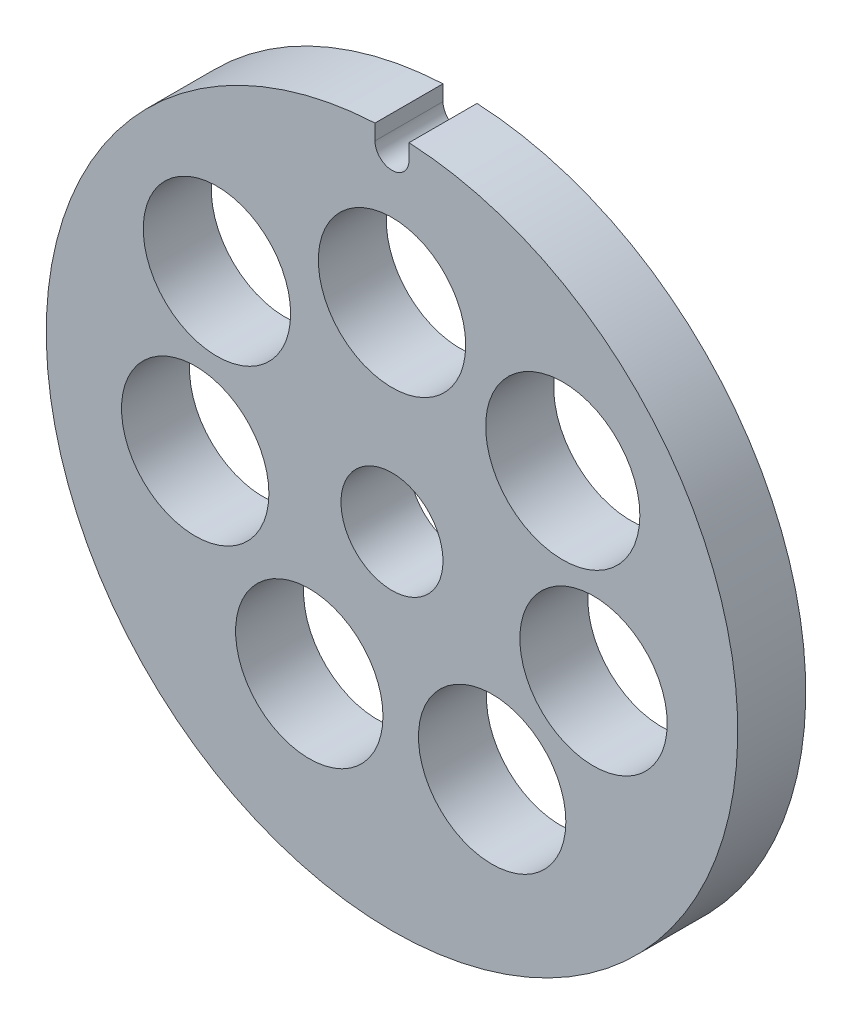
ISO-10303-21;
HEADER;
FILE_DESCRIPTION(('STEP AP214'),'2;1');
FILE_NAME('part.step','',(''),(''),'','','');
FILE_SCHEMA(('AUTOMOTIVE_DESIGN { 1 0 10303 214 1 1 1 1 }'));
ENDSEC;
DATA;
#1=APPLICATION_CONTEXT('core data for automotive mechanical design processes');
#2=APPLICATION_PROTOCOL_DEFINITION('international standard','automotive_design',2000,#1);
#3=PRODUCT_CONTEXT('',#1,'mechanical');
#4=PRODUCT('Part','Part','',(#3));
#5=PRODUCT_RELATED_PRODUCT_CATEGORY('part','',(#4));
#6=PRODUCT_DEFINITION_FORMATION('','',#4);
#7=PRODUCT_DEFINITION_CONTEXT('part definition',#1,'design');
#8=PRODUCT_DEFINITION('design','',#6,#7);
#9=PRODUCT_DEFINITION_SHAPE('','',#8);
#10=(LENGTH_UNIT() NAMED_UNIT(*) SI_UNIT(.MILLI.,.METRE.));
#11=(NAMED_UNIT(*) PLANE_ANGLE_UNIT() SI_UNIT($,.RADIAN.));
#12=(NAMED_UNIT(*) SI_UNIT($,.STERADIAN.) SOLID_ANGLE_UNIT());
#13=UNCERTAINTY_MEASURE_WITH_UNIT(LENGTH_MEASURE(1.E-05),#10,'distance_accuracy_value','');
#14=(GEOMETRIC_REPRESENTATION_CONTEXT(3) GLOBAL_UNCERTAINTY_ASSIGNED_CONTEXT((#13)) GLOBAL_UNIT_ASSIGNED_CONTEXT((#10,
#11,#12)) REPRESENTATION_CONTEXT('',''));
#15=CARTESIAN_POINT('',(0.,0.,0.));
#16=DIRECTION('',(0.,0.,1.));
#17=DIRECTION('',(1.,0.,0.));
#18=AXIS2_PLACEMENT_3D('',#15,#16,#17);
#19=CARTESIAN_POINT('',(-19.7988297795738,47.6312890353411,6.));
#20=DIRECTION('',(0.,0.,-1.));
#21=DIRECTION('',(-1.,0.,0.));
#22=AXIS2_PLACEMENT_3D('',#19,#20,#21);
#23=CYLINDRICAL_SURFACE('',#22,1.5);
#24=CARTESIAN_POINT('',(-19.7988297795738,47.6312890353411,0.));
#25=DIRECTION('',(0.,0.,1.));
#26=DIRECTION('',(1.,0.,0.));
#27=AXIS2_PLACEMENT_3D('',#24,#25,#26);
#28=CIRCLE('',#27,1.5);
#29=CARTESIAN_POINT('',(-21.2988297795738,47.6312890353411,0.));
#30=VERTEX_POINT('',#29);
#31=CARTESIAN_POINT('',(-18.2988297795737,47.6312890353411,0.));
#32=VERTEX_POINT('',#31);
#33=EDGE_CURVE('E124',#30,#32,#28,.T.);
#34=ORIENTED_EDGE('',*,*,#33,.F.);
#35=DIRECTION('',(0.,0.,-1.));
#36=VECTOR('',#35,1.);
#37=CARTESIAN_POINT('',(-21.2988297795738,47.6312890353411,6.));
#38=LINE('',#37,#36);
#39=CARTESIAN_POINT('',(-21.2988297795738,47.6312890353411,6.));
#40=VERTEX_POINT('',#39);
#41=EDGE_CURVE('E11',#40,#30,#38,.T.);
#42=ORIENTED_EDGE('',*,*,#41,.F.);
#43=CARTESIAN_POINT('',(-19.7988297795738,47.6312890353411,6.));
#44=DIRECTION('',(0.,0.,1.));
#45=DIRECTION('',(1.,0.,0.));
#46=AXIS2_PLACEMENT_3D('',#43,#44,#45);
#47=CIRCLE('',#46,1.5);
#48=CARTESIAN_POINT('',(-18.2988297795737,47.6312890353411,6.));
#49=VERTEX_POINT('',#48);
#50=EDGE_CURVE('E94',#40,#49,#47,.T.);
#51=ORIENTED_EDGE('',*,*,#50,.T.);
#52=DIRECTION('',(0.,0.,-1.));
#53=VECTOR('',#52,1.);
#54=CARTESIAN_POINT('',(-18.2988297795737,47.6312890353411,6.));
#55=LINE('',#54,#53);
#56=EDGE_CURVE('E74',#49,#32,#55,.T.);
#57=ORIENTED_EDGE('',*,*,#56,.T.);
#58=EDGE_LOOP('',(#34,#42,#51,#57));
#59=FACE_BOUND('',#58,.T.);
#60=ADVANCED_FACE('F36',(#59),#23,.F.);
#61=CARTESIAN_POINT('',(-21.2988297795736,0.,6.));
#62=DIRECTION('',(1.,0.,0.));
#63=DIRECTION('',(0.,1.,0.));
#64=AXIS2_PLACEMENT_3D('',#61,#62,#63);
#65=PLANE('',#64);
#66=DIRECTION('',(0.,-1.,0.));
#67=VECTOR('',#66,1.);
#68=CARTESIAN_POINT('',(-21.2988297795736,0.,0.));
#69=LINE('',#68,#67);
#70=CARTESIAN_POINT('',(-21.2988297795738,48.9943814587968,0.));
#71=VERTEX_POINT('',#70);
#72=EDGE_CURVE('E87',#71,#30,#69,.T.);
#73=ORIENTED_EDGE('',*,*,#72,.F.);
#74=DIRECTION('',(0.,0.,-1.));
#75=VECTOR('',#74,1.);
#76=CARTESIAN_POINT('',(-21.2988297795738,48.9943814587968,6.));
#77=LINE('',#76,#75);
#78=CARTESIAN_POINT('',(-21.2988297795738,48.9943814587968,6.));
#79=VERTEX_POINT('',#78);
#80=EDGE_CURVE('E44',#79,#71,#77,.T.);
#81=ORIENTED_EDGE('',*,*,#80,.F.);
#82=DIRECTION('',(0.,-1.,0.));
#83=VECTOR('',#82,1.);
#84=CARTESIAN_POINT('',(-21.2988297795736,0.,6.));
#85=LINE('',#84,#83);
#86=EDGE_CURVE('E85',#79,#40,#85,.T.);
#87=ORIENTED_EDGE('',*,*,#86,.T.);
#88=ORIENTED_EDGE('',*,*,#41,.T.);
#89=EDGE_LOOP('',(#73,#81,#87,#88));
#90=FACE_BOUND('',#89,.T.);
#91=ADVANCED_FACE('F83',(#90),#65,.T.);
#92=CARTESIAN_POINT('',(-19.7988297795738,18.5312890353411,6.));
#93=DIRECTION('',(0.,0.,-1.));
#94=DIRECTION('',(-1.,0.,0.));
#95=AXIS2_PLACEMENT_3D('',#92,#93,#94);
#96=CYLINDRICAL_SURFACE('',#95,30.5);
#97=CARTESIAN_POINT('',(-19.7988297795738,18.5312890353411,0.));
#98=DIRECTION('',(0.,0.,1.));
#99=DIRECTION('',(1.,0.,0.));
#100=AXIS2_PLACEMENT_3D('',#97,#98,#99);
#101=CIRCLE('',#100,30.5);
#102=CARTESIAN_POINT('',(-18.2988297795738,48.9943814587968,0.));
#103=VERTEX_POINT('',#102);
#104=EDGE_CURVE('E67',#71,#103,#101,.T.);
#105=ORIENTED_EDGE('',*,*,#104,.T.);
#106=DIRECTION('',(0.,0.,-1.));
#107=VECTOR('',#106,1.);
#108=CARTESIAN_POINT('',(-18.2988297795738,48.9943814587968,6.));
#109=LINE('',#108,#107);
#110=CARTESIAN_POINT('',(-18.2988297795738,48.9943814587968,6.));
#111=VERTEX_POINT('',#110);
#112=EDGE_CURVE('E88',#111,#103,#109,.T.);
#113=ORIENTED_EDGE('',*,*,#112,.F.);
#114=CARTESIAN_POINT('',(-19.7988297795738,18.5312890353411,6.));
#115=DIRECTION('',(0.,0.,1.));
#116=DIRECTION('',(1.,0.,0.));
#117=AXIS2_PLACEMENT_3D('',#114,#115,#116);
#118=CIRCLE('',#117,30.5);
#119=EDGE_CURVE('E89',#79,#111,#118,.T.);
#120=ORIENTED_EDGE('',*,*,#119,.F.);
#121=ORIENTED_EDGE('',*,*,#80,.T.);
#122=EDGE_LOOP('',(#105,#113,#120,#121));
#123=FACE_BOUND('',#122,.T.);
#124=ADVANCED_FACE('F90',(#123),#96,.T.);
#125=CARTESIAN_POINT('',(-19.797413553315,36.0312889780355,6.));
#126=DIRECTION('',(0.,0.,-1.));
#127=DIRECTION('',(-1.,0.,0.));
#128=AXIS2_PLACEMENT_3D('',#125,#126,#127);
#129=CYLINDRICAL_SURFACE('',#128,6.5);
#130=CARTESIAN_POINT('',(-19.797413553315,36.0312889780355,6.));
#131=DIRECTION('',(0.,0.,1.));
#132=DIRECTION('',(1.,0.,0.));
#133=AXIS2_PLACEMENT_3D('',#130,#131,#132);
#134=CIRCLE('',#133,6.5);
#135=CARTESIAN_POINT('',(-13.297413553315,36.0312889780355,6.));
#136=VERTEX_POINT('',#135);
#137=EDGE_CURVE('E118',#136,#136,#134,.T.);
#138=ORIENTED_EDGE('',*,*,#137,.T.);
#139=EDGE_LOOP('',(#138));
#140=FACE_BOUND('',#139,.T.);
#141=CARTESIAN_POINT('',(-19.797413553315,36.0312889780355,0.));
#142=DIRECTION('',(0.,0.,1.));
#143=DIRECTION('',(1.,0.,0.));
#144=AXIS2_PLACEMENT_3D('',#141,#142,#143);
#145=CIRCLE('',#144,6.5);
#146=CARTESIAN_POINT('',(-13.297413553315,36.0312889780355,0.));
#147=VERTEX_POINT('',#146);
#148=EDGE_CURVE('E149',#147,#147,#145,.T.);
#149=ORIENTED_EDGE('',*,*,#148,.F.);
#150=EDGE_LOOP('',(#149));
#151=FACE_BOUND('',#150,.T.);
#152=ADVANCED_FACE('F168',(#140,#151),#129,.F.);
#153=CARTESIAN_POINT('',(-4.73524560022959,30.7018471864994,6.));
#154=DIRECTION('',(0.,0.,-1.));
#155=DIRECTION('',(-1.,0.,0.));
#156=AXIS2_PLACEMENT_3D('',#153,#154,#155);
#157=CYLINDRICAL_SURFACE('',#156,6.80041907319793);
#158=CARTESIAN_POINT('',(-4.73524560022959,30.7018471864994,6.));
#159=DIRECTION('',(0.,0.,1.));
#160=DIRECTION('',(1.,0.,0.));
#161=AXIS2_PLACEMENT_3D('',#158,#159,#160);
#162=CIRCLE('',#161,6.80041907319793);
#163=CARTESIAN_POINT('',(2.06517347296834,30.7018471864994,6.));
#164=VERTEX_POINT('',#163);
#165=EDGE_CURVE('E115',#164,#164,#162,.T.);
#166=ORIENTED_EDGE('',*,*,#165,.T.);
#167=EDGE_LOOP('',(#166));
#168=FACE_BOUND('',#167,.T.);
#169=CARTESIAN_POINT('',(-4.73524560022959,30.7018471864994,0.));
#170=DIRECTION('',(0.,0.,1.));
#171=DIRECTION('',(1.,0.,0.));
#172=AXIS2_PLACEMENT_3D('',#169,#170,#171);
#173=CIRCLE('',#172,6.80041907319793);
#174=CARTESIAN_POINT('',(2.06517347296834,30.7018471864994,0.));
#175=VERTEX_POINT('',#174);
#176=EDGE_CURVE('E146',#175,#175,#173,.T.);
#177=ORIENTED_EDGE('',*,*,#176,.F.);
#178=EDGE_LOOP('',(#177));
#179=FACE_BOUND('',#178,.T.);
#180=ADVANCED_FACE('F193',(#168,#179),#157,.F.);
#181=CARTESIAN_POINT('',(-2.02014643579268,16.0083693554292,6.));
#182=DIRECTION('',(0.,0.,-1.));
#183=DIRECTION('',(-1.,0.,0.));
#184=AXIS2_PLACEMENT_3D('',#181,#182,#183);
#185=CYLINDRICAL_SURFACE('',#184,6.5);
#186=CARTESIAN_POINT('',(-2.02014643579268,16.0083693554292,6.));
#187=DIRECTION('',(0.,0.,1.));
#188=DIRECTION('',(1.,0.,0.));
#189=AXIS2_PLACEMENT_3D('',#186,#187,#188);
#190=CIRCLE('',#189,6.5);
#191=CARTESIAN_POINT('',(4.47985356420732,16.0083693554292,6.));
#192=VERTEX_POINT('',#191);
#193=EDGE_CURVE('E112',#192,#192,#190,.T.);
#194=ORIENTED_EDGE('',*,*,#193,.T.);
#195=EDGE_LOOP('',(#194));
#196=FACE_BOUND('',#195,.T.);
#197=CARTESIAN_POINT('',(-2.02014643579268,16.0083693554292,0.));
#198=DIRECTION('',(0.,0.,1.));
#199=DIRECTION('',(1.,0.,0.));
#200=AXIS2_PLACEMENT_3D('',#197,#198,#199);
#201=CIRCLE('',#200,6.5);
#202=CARTESIAN_POINT('',(4.47985356420732,16.0083693554292,0.));
#203=VERTEX_POINT('',#202);
#204=EDGE_CURVE('E143',#203,#203,#201,.T.);
#205=ORIENTED_EDGE('',*,*,#204,.F.);
#206=EDGE_LOOP('',(#205));
#207=FACE_BOUND('',#206,.T.);
#208=ADVANCED_FACE('F189',(#196,#207),#185,.F.);
#209=CARTESIAN_POINT('',(-10.9640025068789,4.02999068879585,6.));
#210=DIRECTION('',(0.,0.,-1.));
#211=DIRECTION('',(-1.,0.,0.));
#212=AXIS2_PLACEMENT_3D('',#209,#210,#211);
#213=CYLINDRICAL_SURFACE('',#212,6.5);
#214=CARTESIAN_POINT('',(-10.9640025068789,4.02999068879585,6.));
#215=DIRECTION('',(0.,0.,1.));
#216=DIRECTION('',(1.,0.,0.));
#217=AXIS2_PLACEMENT_3D('',#214,#215,#216);
#218=CIRCLE('',#217,6.5);
#219=CARTESIAN_POINT('',(-4.4640025068789,4.02999068879585,6.));
#220=VERTEX_POINT('',#219);
#221=EDGE_CURVE('E109',#220,#220,#218,.T.);
#222=ORIENTED_EDGE('',*,*,#221,.T.);
#223=EDGE_LOOP('',(#222));
#224=FACE_BOUND('',#223,.T.);
#225=CARTESIAN_POINT('',(-10.9640025068789,4.02999068879585,0.));
#226=DIRECTION('',(0.,0.,1.));
#227=DIRECTION('',(1.,0.,0.));
#228=AXIS2_PLACEMENT_3D('',#225,#226,#227);
#229=CIRCLE('',#228,6.5);
#230=CARTESIAN_POINT('',(-4.4640025068789,4.02999068879585,0.));
#231=VERTEX_POINT('',#230);
#232=EDGE_CURVE('E140',#231,#231,#229,.T.);
#233=ORIENTED_EDGE('',*,*,#232,.F.);
#234=EDGE_LOOP('',(#233));
#235=FACE_BOUND('',#234,.T.);
#236=ADVANCED_FACE('F185',(#224,#235),#213,.F.);
#237=CARTESIAN_POINT('',(-27.0948857779451,4.02999068879585,6.));
#238=DIRECTION('',(0.,0.,-1.));
#239=DIRECTION('',(-1.,0.,0.));
#240=AXIS2_PLACEMENT_3D('',#237,#238,#239);
#241=CYLINDRICAL_SURFACE('',#240,6.5);
#242=CARTESIAN_POINT('',(-27.0948857779451,4.02999068879585,6.));
#243=DIRECTION('',(0.,0.,1.));
#244=DIRECTION('',(1.,0.,0.));
#245=AXIS2_PLACEMENT_3D('',#242,#243,#244);
#246=CIRCLE('',#245,6.5);
#247=CARTESIAN_POINT('',(-20.5948857779451,4.02999068879585,6.));
#248=VERTEX_POINT('',#247);
#249=EDGE_CURVE('E106',#248,#248,#246,.T.);
#250=ORIENTED_EDGE('',*,*,#249,.T.);
#251=EDGE_LOOP('',(#250));
#252=FACE_BOUND('',#251,.T.);
#253=CARTESIAN_POINT('',(-27.0948857779451,4.02999068879585,0.));
#254=DIRECTION('',(0.,0.,1.));
#255=DIRECTION('',(1.,0.,0.));
#256=AXIS2_PLACEMENT_3D('',#253,#254,#255);
#257=CIRCLE('',#256,6.5);
#258=CARTESIAN_POINT('',(-20.5948857779451,4.02999068879585,0.));
#259=VERTEX_POINT('',#258);
#260=EDGE_CURVE('E137',#259,#259,#257,.T.);
#261=ORIENTED_EDGE('',*,*,#260,.F.);
#262=EDGE_LOOP('',(#261));
#263=FACE_BOUND('',#262,.T.);
#264=ADVANCED_FACE('F181',(#252,#263),#241,.F.);
#265=CARTESIAN_POINT('',(-37.1567238579171,16.0083693554292,6.));
#266=DIRECTION('',(0.,0.,-1.));
#267=DIRECTION('',(-1.,0.,0.));
#268=AXIS2_PLACEMENT_3D('',#265,#266,#267);
#269=CYLINDRICAL_SURFACE('',#268,6.5);
#270=CARTESIAN_POINT('',(-37.1567238579171,16.0083693554292,6.));
#271=DIRECTION('',(0.,0.,1.));
#272=DIRECTION('',(1.,0.,0.));
#273=AXIS2_PLACEMENT_3D('',#270,#271,#272);
#274=CIRCLE('',#273,6.5);
#275=CARTESIAN_POINT('',(-30.6567238579171,16.0083693554292,6.));
#276=VERTEX_POINT('',#275);
#277=EDGE_CURVE('E103',#276,#276,#274,.T.);
#278=ORIENTED_EDGE('',*,*,#277,.T.);
#279=EDGE_LOOP('',(#278));
#280=FACE_BOUND('',#279,.T.);
#281=CARTESIAN_POINT('',(-37.1567238579171,16.0083693554292,0.));
#282=DIRECTION('',(0.,0.,1.));
#283=DIRECTION('',(1.,0.,0.));
#284=AXIS2_PLACEMENT_3D('',#281,#282,#283);
#285=CIRCLE('',#284,6.5);
#286=CARTESIAN_POINT('',(-30.6567238579171,16.0083693554292,0.));
#287=VERTEX_POINT('',#286);
#288=EDGE_CURVE('E134',#287,#287,#285,.T.);
#289=ORIENTED_EDGE('',*,*,#288,.F.);
#290=EDGE_LOOP('',(#289));
#291=FACE_BOUND('',#290,.T.);
#292=ADVANCED_FACE('F177',(#280,#291),#269,.F.);
#293=CARTESIAN_POINT('',(-35.2401832712558,30.7018471864994,6.));
#294=DIRECTION('',(0.,0.,-1.));
#295=DIRECTION('',(-1.,0.,0.));
#296=AXIS2_PLACEMENT_3D('',#293,#294,#295);
#297=CYLINDRICAL_SURFACE('',#296,6.5);
#298=CARTESIAN_POINT('',(-35.2401832712558,30.7018471864994,6.));
#299=DIRECTION('',(0.,0.,1.));
#300=DIRECTION('',(1.,0.,0.));
#301=AXIS2_PLACEMENT_3D('',#298,#299,#300);
#302=CIRCLE('',#301,6.5);
#303=CARTESIAN_POINT('',(-28.7401832712558,30.7018471864994,6.));
#304=VERTEX_POINT('',#303);
#305=EDGE_CURVE('E100',#304,#304,#302,.T.);
#306=ORIENTED_EDGE('',*,*,#305,.T.);
#307=EDGE_LOOP('',(#306));
#308=FACE_BOUND('',#307,.T.);
#309=CARTESIAN_POINT('',(-35.2401832712558,30.7018471864994,0.));
#310=DIRECTION('',(0.,0.,1.));
#311=DIRECTION('',(1.,0.,0.));
#312=AXIS2_PLACEMENT_3D('',#309,#310,#311);
#313=CIRCLE('',#312,6.5);
#314=CARTESIAN_POINT('',(-28.7401832712558,30.7018471864994,0.));
#315=VERTEX_POINT('',#314);
#316=EDGE_CURVE('E131',#315,#315,#313,.T.);
#317=ORIENTED_EDGE('',*,*,#316,.F.);
#318=EDGE_LOOP('',(#317));
#319=FACE_BOUND('',#318,.T.);
#320=ADVANCED_FACE('F174',(#308,#319),#297,.F.);
#321=CARTESIAN_POINT('',(-18.2988297795734,-1.36043184006555E-13,6.));
#322=DIRECTION('',(1.,0.,0.));
#323=DIRECTION('',(0.,1.,0.));
#324=AXIS2_PLACEMENT_3D('',#321,#322,#323);
#325=PLANE('',#324);
#326=DIRECTION('',(0.,-1.,0.));
#327=VECTOR('',#326,1.);
#328=CARTESIAN_POINT('',(-18.2988297795734,-1.36043184006555E-13,0.));
#329=LINE('',#328,#327);
#330=EDGE_CURVE('E129',#103,#32,#329,.T.);
#331=ORIENTED_EDGE('',*,*,#330,.T.);
#332=ORIENTED_EDGE('',*,*,#56,.F.);
#333=DIRECTION('',(0.,-1.,0.));
#334=VECTOR('',#333,1.);
#335=CARTESIAN_POINT('',(-18.2988297795734,-1.36043184006555E-13,6.));
#336=LINE('',#335,#334);
#337=EDGE_CURVE('E52',#111,#49,#336,.T.);
#338=ORIENTED_EDGE('',*,*,#337,.F.);
#339=ORIENTED_EDGE('',*,*,#112,.T.);
#340=EDGE_LOOP('',(#331,#332,#338,#339));
#341=FACE_BOUND('',#340,.T.);
#342=ADVANCED_FACE('F157',(#341),#325,.F.);
#343=CARTESIAN_POINT('',(-19.7988297795738,18.5312890353411,6.));
#344=DIRECTION('',(0.,0.,-1.));
#345=DIRECTION('',(-1.,0.,0.));
#346=AXIS2_PLACEMENT_3D('',#343,#344,#345);
#347=CYLINDRICAL_SURFACE('',#346,4.5);
#348=CARTESIAN_POINT('',(-19.7988297795738,18.5312890353411,6.));
#349=DIRECTION('',(0.,0.,1.));
#350=DIRECTION('',(1.,0.,0.));
#351=AXIS2_PLACEMENT_3D('',#348,#349,#350);
#352=CIRCLE('',#351,4.5);
#353=CARTESIAN_POINT('',(-15.2988297795738,18.5312890353411,6.));
#354=VERTEX_POINT('',#353);
#355=EDGE_CURVE('E121',#354,#354,#352,.T.);
#356=ORIENTED_EDGE('',*,*,#355,.T.);
#357=EDGE_LOOP('',(#356));
#358=FACE_BOUND('',#357,.T.);
#359=CARTESIAN_POINT('',(-19.7988297795738,18.5312890353411,0.));
#360=DIRECTION('',(0.,0.,1.));
#361=DIRECTION('',(1.,0.,0.));
#362=AXIS2_PLACEMENT_3D('',#359,#360,#361);
#363=CIRCLE('',#362,4.5);
#364=CARTESIAN_POINT('',(-15.2988297795738,18.5312890353411,0.));
#365=VERTEX_POINT('',#364);
#366=EDGE_CURVE('E96',#365,#365,#363,.T.);
#367=ORIENTED_EDGE('',*,*,#366,.F.);
#368=EDGE_LOOP('',(#367));
#369=FACE_BOUND('',#368,.T.);
#370=ADVANCED_FACE('F173',(#358,#369),#347,.F.);
#371=CARTESIAN_POINT('',(0.,0.,6.));
#372=DIRECTION('',(0.,0.,1.));
#373=DIRECTION('',(1.,0.,0.));
#374=AXIS2_PLACEMENT_3D('',#371,#372,#373);
#375=PLANE('',#374);
#376=ORIENTED_EDGE('',*,*,#50,.F.);
#377=ORIENTED_EDGE('',*,*,#86,.F.);
#378=ORIENTED_EDGE('',*,*,#119,.T.);
#379=ORIENTED_EDGE('',*,*,#337,.T.);
#380=EDGE_LOOP('',(#376,#377,#378,#379));
#381=FACE_BOUND('',#380,.T.);
#382=ORIENTED_EDGE('',*,*,#305,.F.);
#383=EDGE_LOOP('',(#382));
#384=FACE_BOUND('',#383,.T.);
#385=ORIENTED_EDGE('',*,*,#277,.F.);
#386=EDGE_LOOP('',(#385));
#387=FACE_BOUND('',#386,.T.);
#388=ORIENTED_EDGE('',*,*,#249,.F.);
#389=EDGE_LOOP('',(#388));
#390=FACE_BOUND('',#389,.T.);
#391=ORIENTED_EDGE('',*,*,#221,.F.);
#392=EDGE_LOOP('',(#391));
#393=FACE_BOUND('',#392,.T.);
#394=ORIENTED_EDGE('',*,*,#193,.F.);
#395=EDGE_LOOP('',(#394));
#396=FACE_BOUND('',#395,.T.);
#397=ORIENTED_EDGE('',*,*,#165,.F.);
#398=EDGE_LOOP('',(#397));
#399=FACE_BOUND('',#398,.T.);
#400=ORIENTED_EDGE('',*,*,#137,.F.);
#401=EDGE_LOOP('',(#400));
#402=FACE_BOUND('',#401,.T.);
#403=ORIENTED_EDGE('',*,*,#355,.F.);
#404=EDGE_LOOP('',(#403));
#405=FACE_BOUND('',#404,.T.);
#406=ADVANCED_FACE('F92',(#381,#384,#387,#390,#393,#396,#399,#402,#405),#375,.T.);
#407=CARTESIAN_POINT('',(0.,0.,0.));
#408=DIRECTION('',(0.,0.,1.));
#409=DIRECTION('',(1.,0.,0.));
#410=AXIS2_PLACEMENT_3D('',#407,#408,#409);
#411=PLANE('',#410);
#412=ORIENTED_EDGE('',*,*,#33,.T.);
#413=ORIENTED_EDGE('',*,*,#330,.F.);
#414=ORIENTED_EDGE('',*,*,#104,.F.);
#415=ORIENTED_EDGE('',*,*,#72,.T.);
#416=EDGE_LOOP('',(#412,#413,#414,#415));
#417=FACE_BOUND('',#416,.T.);
#418=ORIENTED_EDGE('',*,*,#316,.T.);
#419=EDGE_LOOP('',(#418));
#420=FACE_BOUND('',#419,.T.);
#421=ORIENTED_EDGE('',*,*,#288,.T.);
#422=EDGE_LOOP('',(#421));
#423=FACE_BOUND('',#422,.T.);
#424=ORIENTED_EDGE('',*,*,#260,.T.);
#425=EDGE_LOOP('',(#424));
#426=FACE_BOUND('',#425,.T.);
#427=ORIENTED_EDGE('',*,*,#232,.T.);
#428=EDGE_LOOP('',(#427));
#429=FACE_BOUND('',#428,.T.);
#430=ORIENTED_EDGE('',*,*,#204,.T.);
#431=EDGE_LOOP('',(#430));
#432=FACE_BOUND('',#431,.T.);
#433=ORIENTED_EDGE('',*,*,#176,.T.);
#434=EDGE_LOOP('',(#433));
#435=FACE_BOUND('',#434,.T.);
#436=ORIENTED_EDGE('',*,*,#148,.T.);
#437=EDGE_LOOP('',(#436));
#438=FACE_BOUND('',#437,.T.);
#439=ORIENTED_EDGE('',*,*,#366,.T.);
#440=EDGE_LOOP('',(#439));
#441=FACE_BOUND('',#440,.T.);
#442=ADVANCED_FACE('F159',(#417,#420,#423,#426,#429,#432,#435,#438,#441),#411,.F.);
#443=CLOSED_SHELL('',(#60,#91,#124,#152,#180,#208,#236,#264,#292,#320,#342,#370,#406,#442));
#444=MANIFOLD_SOLID_BREP('B2',#443);
#445=ADVANCED_BREP_SHAPE_REPRESENTATION('',(#18,#444),#14);
#446=SHAPE_DEFINITION_REPRESENTATION(#9,#445);
ENDSEC;
END-ISO-10303-21;
